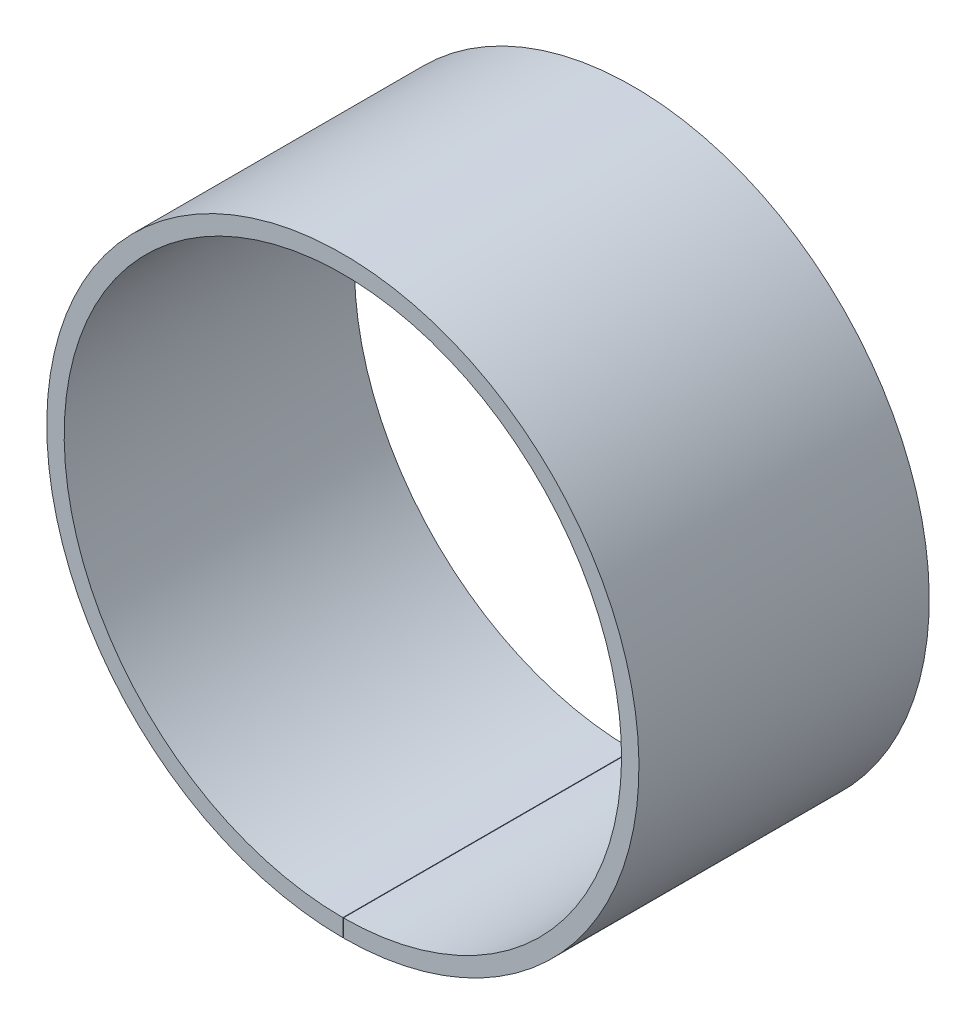
ISO-10303-21;
HEADER;
FILE_DESCRIPTION(('STEP AP214'),'2;1');
FILE_NAME('part.step','',(''),(''),'','','');
FILE_SCHEMA(('AUTOMOTIVE_DESIGN { 1 0 10303 214 1 1 1 1 }'));
ENDSEC;
DATA;
#1=APPLICATION_CONTEXT('core data for automotive mechanical design processes');
#2=APPLICATION_PROTOCOL_DEFINITION('international standard','automotive_design',2000,#1);
#3=PRODUCT_CONTEXT('',#1,'mechanical');
#4=PRODUCT('Part','Part','',(#3));
#5=PRODUCT_RELATED_PRODUCT_CATEGORY('part','',(#4));
#6=PRODUCT_DEFINITION_FORMATION('','',#4);
#7=PRODUCT_DEFINITION_CONTEXT('part definition',#1,'design');
#8=PRODUCT_DEFINITION('design','',#6,#7);
#9=PRODUCT_DEFINITION_SHAPE('','',#8);
#10=(LENGTH_UNIT() NAMED_UNIT(*) SI_UNIT(.MILLI.,.METRE.));
#11=(NAMED_UNIT(*) PLANE_ANGLE_UNIT() SI_UNIT($,.RADIAN.));
#12=(NAMED_UNIT(*) SI_UNIT($,.STERADIAN.) SOLID_ANGLE_UNIT());
#13=UNCERTAINTY_MEASURE_WITH_UNIT(LENGTH_MEASURE(1.E-05),#10,'distance_accuracy_value','');
#14=(GEOMETRIC_REPRESENTATION_CONTEXT(3) GLOBAL_UNCERTAINTY_ASSIGNED_CONTEXT((#13)) GLOBAL_UNIT_ASSIGNED_CONTEXT((#10,
#11,#12)) REPRESENTATION_CONTEXT('',''));
#15=CARTESIAN_POINT('',(0.,0.,0.));
#16=DIRECTION('',(0.,0.,1.));
#17=DIRECTION('',(1.,0.,0.));
#18=AXIS2_PLACEMENT_3D('',#15,#16,#17);
#19=CARTESIAN_POINT('',(0.,0.,50.));
#20=DIRECTION('',(0.,0.,-1.));
#21=DIRECTION('',(-1.,0.,0.));
#22=AXIS2_PLACEMENT_3D('',#19,#20,#21);
#23=CYLINDRICAL_SURFACE('',#22,48.);
#24=CARTESIAN_POINT('',(0.,0.,0.));
#25=DIRECTION('',(0.,0.,1.));
#26=DIRECTION('',(1.,0.,0.));
#27=AXIS2_PLACEMENT_3D('',#24,#25,#26);
#28=CIRCLE('',#27,48.);
#29=CARTESIAN_POINT('',(0.,-48.,0.));
#30=VERTEX_POINT('',#29);
#31=CARTESIAN_POINT('',(0.0837757615631048,-47.9999268918378,0.));
#32=VERTEX_POINT('',#31);
#33=EDGE_CURVE('E102',#30,#32,#28,.F.);
#34=ORIENTED_EDGE('',*,*,#33,.T.);
#35=DIRECTION('',(0.,0.,-1.));
#36=VECTOR('',#35,1.);
#37=CARTESIAN_POINT('',(0.0837757615631048,-47.9999268918378,50.));
#38=LINE('',#37,#36);
#39=CARTESIAN_POINT('',(0.0837757615631048,-47.9999268918378,50.));
#40=VERTEX_POINT('',#39);
#41=EDGE_CURVE('E11',#40,#32,#38,.T.);
#42=ORIENTED_EDGE('',*,*,#41,.F.);
#43=CARTESIAN_POINT('',(0.,0.,50.));
#44=DIRECTION('',(0.,0.,1.));
#45=DIRECTION('',(1.,0.,0.));
#46=AXIS2_PLACEMENT_3D('',#43,#44,#45);
#47=CIRCLE('',#46,48.);
#48=CARTESIAN_POINT('',(0.,-48.,50.));
#49=VERTEX_POINT('',#48);
#50=EDGE_CURVE('E79',#49,#40,#47,.F.);
#51=ORIENTED_EDGE('',*,*,#50,.F.);
#52=DIRECTION('',(0.,0.,-1.));
#53=VECTOR('',#52,1.);
#54=CARTESIAN_POINT('',(0.,-48.,50.));
#55=LINE('',#54,#53);
#56=EDGE_CURVE('E55',#49,#30,#55,.T.);
#57=ORIENTED_EDGE('',*,*,#56,.T.);
#58=EDGE_LOOP('',(#34,#42,#51,#57));
#59=FACE_BOUND('',#58,.T.);
#60=ADVANCED_FACE('F39',(#59),#23,.F.);
#61=CARTESIAN_POINT('',(0.0890117466608176,-50.9999223225777,50.));
#62=DIRECTION('',(-0.999998476913288,-0.00174532836590426,0.));
#63=DIRECTION('',(0.00174532836590426,-0.999998476913288,0.));
#64=AXIS2_PLACEMENT_3D('',#61,#62,#63);
#65=PLANE('',#64);
#66=DIRECTION('',(-0.00174532836590426,0.999998476913288,0.));
#67=VECTOR('',#66,1.);
#68=CARTESIAN_POINT('',(0.0890117466608176,-50.9999223225777,0.));
#69=LINE('',#68,#67);
#70=CARTESIAN_POINT('',(0.0890117466608176,-50.9999223225777,0.));
#71=VERTEX_POINT('',#70);
#72=EDGE_CURVE('E88',#71,#32,#69,.T.);
#73=ORIENTED_EDGE('',*,*,#72,.F.);
#74=DIRECTION('',(0.,0.,-1.));
#75=VECTOR('',#74,1.);
#76=CARTESIAN_POINT('',(0.0890117466608176,-50.9999223225777,50.));
#77=LINE('',#76,#75);
#78=CARTESIAN_POINT('',(0.0890117466608176,-50.9999223225777,50.));
#79=VERTEX_POINT('',#78);
#80=EDGE_CURVE('E47',#79,#71,#77,.T.);
#81=ORIENTED_EDGE('',*,*,#80,.F.);
#82=DIRECTION('',(-0.00174532836590426,0.999998476913288,0.));
#83=VECTOR('',#82,1.);
#84=CARTESIAN_POINT('',(0.0890117466608176,-50.9999223225777,50.));
#85=LINE('',#84,#83);
#86=EDGE_CURVE('E86',#79,#40,#85,.T.);
#87=ORIENTED_EDGE('',*,*,#86,.T.);
#88=ORIENTED_EDGE('',*,*,#41,.T.);
#89=EDGE_LOOP('',(#73,#81,#87,#88));
#90=FACE_BOUND('',#89,.T.);
#91=ADVANCED_FACE('F85',(#90),#65,.T.);
#92=CARTESIAN_POINT('',(0.,0.,50.));
#93=DIRECTION('',(0.,0.,-1.));
#94=DIRECTION('',(-1.,0.,0.));
#95=AXIS2_PLACEMENT_3D('',#92,#93,#94);
#96=CYLINDRICAL_SURFACE('',#95,51.);
#97=CARTESIAN_POINT('',(0.,0.,0.));
#98=DIRECTION('',(0.,0.,-1.));
#99=DIRECTION('',(-1.,0.,0.));
#100=AXIS2_PLACEMENT_3D('',#97,#98,#99);
#101=CIRCLE('',#100,51.);
#102=CARTESIAN_POINT('',(0.,-51.,0.));
#103=VERTEX_POINT('',#102);
#104=EDGE_CURVE('E105',#103,#71,#101,.T.);
#105=ORIENTED_EDGE('',*,*,#104,.F.);
#106=DIRECTION('',(0.,0.,-1.));
#107=VECTOR('',#106,1.);
#108=CARTESIAN_POINT('',(0.,-51.,50.));
#109=LINE('',#108,#107);
#110=CARTESIAN_POINT('',(0.,-51.,50.));
#111=VERTEX_POINT('',#110);
#112=EDGE_CURVE('E68',#111,#103,#109,.T.);
#113=ORIENTED_EDGE('',*,*,#112,.F.);
#114=CARTESIAN_POINT('',(0.,0.,50.));
#115=DIRECTION('',(0.,0.,-1.));
#116=DIRECTION('',(-1.,0.,0.));
#117=AXIS2_PLACEMENT_3D('',#114,#115,#116);
#118=CIRCLE('',#117,51.);
#119=EDGE_CURVE('E94',#111,#79,#118,.T.);
#120=ORIENTED_EDGE('',*,*,#119,.T.);
#121=ORIENTED_EDGE('',*,*,#80,.T.);
#122=EDGE_LOOP('',(#105,#113,#120,#121));
#123=FACE_BOUND('',#122,.T.);
#124=ADVANCED_FACE('F96',(#123),#96,.T.);
#125=CARTESIAN_POINT('',(0.,-48.,50.));
#126=DIRECTION('',(1.,0.,0.));
#127=DIRECTION('',(0.,1.,0.));
#128=AXIS2_PLACEMENT_3D('',#125,#126,#127);
#129=PLANE('',#128);
#130=DIRECTION('',(0.,-1.,0.));
#131=VECTOR('',#130,1.);
#132=CARTESIAN_POINT('',(0.,-48.,0.));
#133=LINE('',#132,#131);
#134=EDGE_CURVE('E107',#30,#103,#133,.T.);
#135=ORIENTED_EDGE('',*,*,#134,.F.);
#136=ORIENTED_EDGE('',*,*,#56,.F.);
#137=DIRECTION('',(0.,-1.,0.));
#138=VECTOR('',#137,1.);
#139=CARTESIAN_POINT('',(0.,-48.,50.));
#140=LINE('',#139,#138);
#141=EDGE_CURVE('E97',#49,#111,#140,.T.);
#142=ORIENTED_EDGE('',*,*,#141,.T.);
#143=ORIENTED_EDGE('',*,*,#112,.T.);
#144=EDGE_LOOP('',(#135,#136,#142,#143));
#145=FACE_BOUND('',#144,.T.);
#146=ADVANCED_FACE('F113',(#145),#129,.T.);
#147=CARTESIAN_POINT('',(0.,0.,50.));
#148=DIRECTION('',(0.,0.,1.));
#149=DIRECTION('',(1.,0.,0.));
#150=AXIS2_PLACEMENT_3D('',#147,#148,#149);
#151=PLANE('',#150);
#152=ORIENTED_EDGE('',*,*,#50,.T.);
#153=ORIENTED_EDGE('',*,*,#86,.F.);
#154=ORIENTED_EDGE('',*,*,#119,.F.);
#155=ORIENTED_EDGE('',*,*,#141,.F.);
#156=EDGE_LOOP('',(#152,#153,#154,#155));
#157=FACE_BOUND('',#156,.T.);
#158=ADVANCED_FACE('F93',(#157),#151,.T.);
#159=CARTESIAN_POINT('',(0.,0.,0.));
#160=DIRECTION('',(0.,0.,1.));
#161=DIRECTION('',(1.,0.,0.));
#162=AXIS2_PLACEMENT_3D('',#159,#160,#161);
#163=PLANE('',#162);
#164=ORIENTED_EDGE('',*,*,#33,.F.);
#165=ORIENTED_EDGE('',*,*,#134,.T.);
#166=ORIENTED_EDGE('',*,*,#104,.T.);
#167=ORIENTED_EDGE('',*,*,#72,.T.);
#168=EDGE_LOOP('',(#164,#165,#166,#167));
#169=FACE_BOUND('',#168,.T.);
#170=ADVANCED_FACE('F112',(#169),#163,.F.);
#171=CLOSED_SHELL('',(#60,#91,#124,#146,#158,#170));
#172=MANIFOLD_SOLID_BREP('B2',#171);
#173=ADVANCED_BREP_SHAPE_REPRESENTATION('',(#18,#172),#14);
#174=SHAPE_DEFINITION_REPRESENTATION(#9,#173);
ENDSEC;
END-ISO-10303-21;
